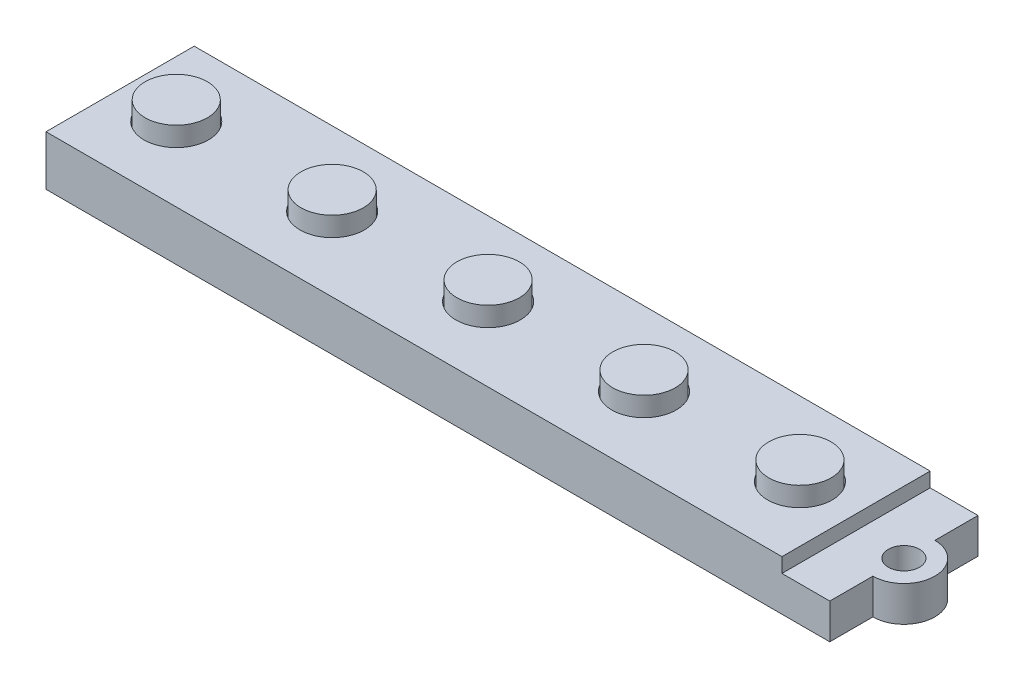
ISO-10303-21;
HEADER;
FILE_DESCRIPTION(('STEP AP214'),'2;1');
FILE_NAME('part.step','',(''),(''),'','','');
FILE_SCHEMA(('AUTOMOTIVE_DESIGN { 1 0 10303 214 1 1 1 1 }'));
ENDSEC;
DATA;
#1=APPLICATION_CONTEXT('core data for automotive mechanical design processes');
#2=APPLICATION_PROTOCOL_DEFINITION('international standard','automotive_design',2000,#1);
#3=PRODUCT_CONTEXT('',#1,'mechanical');
#4=PRODUCT('Part','Part','',(#3));
#5=PRODUCT_RELATED_PRODUCT_CATEGORY('part','',(#4));
#6=PRODUCT_DEFINITION_FORMATION('','',#4);
#7=PRODUCT_DEFINITION_CONTEXT('part definition',#1,'design');
#8=PRODUCT_DEFINITION('design','',#6,#7);
#9=PRODUCT_DEFINITION_SHAPE('','',#8);
#10=(LENGTH_UNIT() NAMED_UNIT(*) SI_UNIT(.MILLI.,.METRE.));
#11=(NAMED_UNIT(*) PLANE_ANGLE_UNIT() SI_UNIT($,.RADIAN.));
#12=(NAMED_UNIT(*) SI_UNIT($,.STERADIAN.) SOLID_ANGLE_UNIT());
#13=UNCERTAINTY_MEASURE_WITH_UNIT(LENGTH_MEASURE(1.E-05),#10,'distance_accuracy_value','');
#14=(GEOMETRIC_REPRESENTATION_CONTEXT(3) GLOBAL_UNCERTAINTY_ASSIGNED_CONTEXT((#13)) GLOBAL_UNIT_ASSIGNED_CONTEXT((#10,
#11,#12)) REPRESENTATION_CONTEXT('',''));
#15=CARTESIAN_POINT('',(0.,0.,0.));
#16=DIRECTION('',(0.,0.,1.));
#17=DIRECTION('',(1.,0.,0.));
#18=AXIS2_PLACEMENT_3D('',#15,#16,#17);
#19=CARTESIAN_POINT('',(0.,0.,0.));
#20=DIRECTION('',(0.,1.,0.));
#21=DIRECTION('',(0.,0.,1.));
#22=AXIS2_PLACEMENT_3D('',#19,#20,#21);
#23=PLANE('',#22);
#24=CARTESIAN_POINT('',(-20.4046666666667,0.,-25.8942737373737));
#25=DIRECTION('',(0.,1.,0.));
#26=DIRECTION('',(0.,0.,1.));
#27=AXIS2_PLACEMENT_3D('',#24,#25,#26);
#28=CIRCLE('',#27,1.905);
#29=CARTESIAN_POINT('',(-20.4046666666667,0.,-23.9892737373737));
#30=VERTEX_POINT('',#29);
#31=EDGE_CURVE('E222',#30,#30,#28,.T.);
#32=ORIENTED_EDGE('',*,*,#31,.T.);
#33=EDGE_LOOP('',(#32));
#34=FACE_BOUND('',#33,.T.);
#35=DIRECTION('',(0.,0.,-1.));
#36=VECTOR('',#35,1.);
#37=CARTESIAN_POINT('',(-112.479666666667,0.,-32.2442737373737));
#38=LINE('',#37,#36);
#39=CARTESIAN_POINT('',(-112.479666666667,0.,-19.5442737373737));
#40=VERTEX_POINT('',#39);
#41=CARTESIAN_POINT('',(-112.479666666667,0.,-32.2442737373737));
#42=VERTEX_POINT('',#41);
#43=EDGE_CURVE('E161',#40,#42,#38,.T.);
#44=ORIENTED_EDGE('',*,*,#43,.F.);
#45=DIRECTION('',(-1.,0.,0.));
#46=VECTOR('',#45,1.);
#47=CARTESIAN_POINT('',(-29.9296666666666,0.,-19.5442737373737));
#48=LINE('',#47,#46);
#49=CARTESIAN_POINT('',(-29.9296666666666,0.,-19.5442737373737));
#50=VERTEX_POINT('',#49);
#51=EDGE_CURVE('E166',#50,#40,#48,.T.);
#52=ORIENTED_EDGE('',*,*,#51,.F.);
#53=DIRECTION('',(0.,0.,1.));
#54=VECTOR('',#53,1.);
#55=CARTESIAN_POINT('',(-29.9296666666666,0.,-32.2442737373737));
#56=LINE('',#55,#54);
#57=CARTESIAN_POINT('',(-29.9296666666666,0.,-32.2442737373737));
#58=VERTEX_POINT('',#57);
#59=EDGE_CURVE('E176',#58,#50,#56,.T.);
#60=ORIENTED_EDGE('',*,*,#59,.F.);
#61=DIRECTION('',(1.,0.,0.));
#62=VECTOR('',#61,1.);
#63=CARTESIAN_POINT('',(-29.9296666666666,0.,-32.2442737373737));
#64=LINE('',#63,#62);
#65=EDGE_CURVE('E59',#42,#58,#64,.T.);
#66=ORIENTED_EDGE('',*,*,#65,.F.);
#67=EDGE_LOOP('',(#44,#52,#60,#66));
#68=FACE_BOUND('',#67,.T.);
#69=DIRECTION('',(-1.,0.,0.));
#70=VECTOR('',#69,1.);
#71=CARTESIAN_POINT('',(-116.162666666667,0.,-34.9493737373737));
#72=LINE('',#71,#70);
#73=CARTESIAN_POINT('',(-20.4046666666667,0.,-34.9493737373737));
#74=VERTEX_POINT('',#73);
#75=CARTESIAN_POINT('',(-116.162666666667,0.,-34.9493737373737));
#76=VERTEX_POINT('',#75);
#77=EDGE_CURVE('E244',#74,#76,#72,.T.);
#78=ORIENTED_EDGE('',*,*,#77,.F.);
#79=DIRECTION('',(0.,0.,1.));
#80=VECTOR('',#79,1.);
#81=CARTESIAN_POINT('',(-20.4046666666667,0.,0.));
#82=LINE('',#81,#80);
#83=CARTESIAN_POINT('',(-20.4046666666667,0.,-29.6800450522713));
#84=VERTEX_POINT('',#83);
#85=EDGE_CURVE('E158',#74,#84,#82,.T.);
#86=ORIENTED_EDGE('',*,*,#85,.T.);
#87=CARTESIAN_POINT('',(-20.4046666666667,0.,-25.8942737373737));
#88=DIRECTION('',(0.,1.,0.));
#89=DIRECTION('',(0.,0.,1.));
#90=AXIS2_PLACEMENT_3D('',#87,#88,#89);
#91=CIRCLE('',#90,3.78577131489756);
#92=CARTESIAN_POINT('',(-20.4046666666667,0.,-22.1085024224762));
#93=VERTEX_POINT('',#92);
#94=EDGE_CURVE('E154',#84,#93,#91,.F.);
#95=ORIENTED_EDGE('',*,*,#94,.T.);
#96=DIRECTION('',(0.,0.,1.));
#97=VECTOR('',#96,1.);
#98=CARTESIAN_POINT('',(-20.4046666666666,0.,0.));
#99=LINE('',#98,#97);
#100=CARTESIAN_POINT('',(-20.4046666666666,0.,-16.8391737373737));
#101=VERTEX_POINT('',#100);
#102=EDGE_CURVE('E132',#93,#101,#99,.T.);
#103=ORIENTED_EDGE('',*,*,#102,.T.);
#104=DIRECTION('',(1.,0.,0.));
#105=VECTOR('',#104,1.);
#106=CARTESIAN_POINT('',(-116.162666666667,0.,-16.8391737373737));
#107=LINE('',#106,#105);
#108=CARTESIAN_POINT('',(-116.162666666667,0.,-16.8391737373737));
#109=VERTEX_POINT('',#108);
#110=EDGE_CURVE('E251',#109,#101,#107,.T.);
#111=ORIENTED_EDGE('',*,*,#110,.F.);
#112=DIRECTION('',(0.,0.,1.));
#113=VECTOR('',#112,1.);
#114=CARTESIAN_POINT('',(-116.162666666667,0.,-34.9493737373737));
#115=LINE('',#114,#113);
#116=EDGE_CURVE('E237',#76,#109,#115,.T.);
#117=ORIENTED_EDGE('',*,*,#116,.F.);
#118=EDGE_LOOP('',(#78,#86,#95,#103,#111,#117));
#119=FACE_BOUND('',#118,.T.);
#120=ADVANCED_FACE('F36',(#34,#68,#119),#23,.F.);
#121=CARTESIAN_POINT('',(0.,4.318,0.));
#122=DIRECTION('',(0.,1.,0.));
#123=DIRECTION('',(0.,0.,1.));
#124=AXIS2_PLACEMENT_3D('',#121,#122,#123);
#125=PLANE('',#124);
#126=CARTESIAN_POINT('',(-20.4046666666667,4.318,-25.8942737373737));
#127=DIRECTION('',(0.,1.,0.));
#128=DIRECTION('',(0.,0.,1.));
#129=AXIS2_PLACEMENT_3D('',#126,#127,#128);
#130=CIRCLE('',#129,1.905);
#131=CARTESIAN_POINT('',(-20.4046666666667,4.318,-23.9892737373737));
#132=VERTEX_POINT('',#131);
#133=EDGE_CURVE('E219',#132,#132,#130,.T.);
#134=ORIENTED_EDGE('',*,*,#133,.F.);
#135=EDGE_LOOP('',(#134));
#136=FACE_BOUND('',#135,.T.);
#137=DIRECTION('',(0.,0.,1.));
#138=VECTOR('',#137,1.);
#139=CARTESIAN_POINT('',(-20.4046666666667,4.318,-34.9493737373737));
#140=LINE('',#139,#138);
#141=CARTESIAN_POINT('',(-20.4046666666667,4.318,-34.9493737373737));
#142=VERTEX_POINT('',#141);
#143=CARTESIAN_POINT('',(-20.4046666666667,4.318,-29.6800450522713));
#144=VERTEX_POINT('',#143);
#145=EDGE_CURVE('E51',#142,#144,#140,.T.);
#146=ORIENTED_EDGE('',*,*,#145,.F.);
#147=DIRECTION('',(-1.,0.,0.));
#148=VECTOR('',#147,1.);
#149=CARTESIAN_POINT('',(-26.2466666666667,4.318,-34.9493737373737));
#150=LINE('',#149,#148);
#151=CARTESIAN_POINT('',(-26.2466666666667,4.318,-34.9493737373737));
#152=VERTEX_POINT('',#151);
#153=EDGE_CURVE('E231',#142,#152,#150,.T.);
#154=ORIENTED_EDGE('',*,*,#153,.T.);
#155=DIRECTION('',(0.,0.,1.));
#156=VECTOR('',#155,1.);
#157=CARTESIAN_POINT('',(-26.2466666666667,4.318,-34.9493737373737));
#158=LINE('',#157,#156);
#159=CARTESIAN_POINT('',(-26.2466666666667,4.318,-16.8391737373737));
#160=VERTEX_POINT('',#159);
#161=EDGE_CURVE('E228',#152,#160,#158,.T.);
#162=ORIENTED_EDGE('',*,*,#161,.T.);
#163=DIRECTION('',(1.,0.,0.));
#164=VECTOR('',#163,1.);
#165=CARTESIAN_POINT('',(-26.2466666666667,4.318,-16.8391737373737));
#166=LINE('',#165,#164);
#167=CARTESIAN_POINT('',(-20.4046666666666,4.318,-16.8391737373737));
#168=VERTEX_POINT('',#167);
#169=EDGE_CURVE('E147',#160,#168,#166,.T.);
#170=ORIENTED_EDGE('',*,*,#169,.T.);
#171=DIRECTION('',(0.,0.,1.));
#172=VECTOR('',#171,1.);
#173=CARTESIAN_POINT('',(-20.4046666666667,4.318,-22.1085024224762));
#174=LINE('',#173,#172);
#175=CARTESIAN_POINT('',(-20.4046666666667,4.318,-22.1085024224762));
#176=VERTEX_POINT('',#175);
#177=EDGE_CURVE('E129',#176,#168,#174,.T.);
#178=ORIENTED_EDGE('',*,*,#177,.F.);
#179=CARTESIAN_POINT('',(-20.4046666666667,4.318,-25.8942737373737));
#180=DIRECTION('',(0.,-1.,0.));
#181=DIRECTION('',(0.,0.,1.));
#182=AXIS2_PLACEMENT_3D('',#179,#180,#181);
#183=CIRCLE('',#182,3.78577131489756);
#184=EDGE_CURVE('E139',#144,#176,#183,.T.);
#185=ORIENTED_EDGE('',*,*,#184,.F.);
#186=EDGE_LOOP('',(#146,#154,#162,#170,#178,#185));
#187=FACE_BOUND('',#186,.T.);
#188=ADVANCED_FACE('F144',(#136,#187),#125,.T.);
#189=CARTESIAN_POINT('',(-116.162666666667,6.096,-34.9493737373737));
#190=DIRECTION('',(1.,0.,0.));
#191=DIRECTION('',(0.,0.,-1.));
#192=AXIS2_PLACEMENT_3D('',#189,#190,#191);
#193=PLANE('',#192);
#194=ORIENTED_EDGE('',*,*,#116,.T.);
#195=DIRECTION('',(0.,-1.,0.));
#196=VECTOR('',#195,1.);
#197=CARTESIAN_POINT('',(-116.162666666667,6.096,-16.8391737373737));
#198=LINE('',#197,#196);
#199=CARTESIAN_POINT('',(-116.162666666667,6.096,-16.8391737373737));
#200=VERTEX_POINT('',#199);
#201=EDGE_CURVE('E11',#200,#109,#198,.T.);
#202=ORIENTED_EDGE('',*,*,#201,.F.);
#203=DIRECTION('',(0.,0.,1.));
#204=VECTOR('',#203,1.);
#205=CARTESIAN_POINT('',(-116.162666666667,6.096,-34.9493737373737));
#206=LINE('',#205,#204);
#207=CARTESIAN_POINT('',(-116.162666666667,6.096,-34.9493737373737));
#208=VERTEX_POINT('',#207);
#209=EDGE_CURVE('E240',#208,#200,#206,.T.);
#210=ORIENTED_EDGE('',*,*,#209,.F.);
#211=DIRECTION('',(0.,-1.,0.));
#212=VECTOR('',#211,1.);
#213=CARTESIAN_POINT('',(-116.162666666667,6.096,-34.9493737373737));
#214=LINE('',#213,#212);
#215=EDGE_CURVE('E44',#208,#76,#214,.T.);
#216=ORIENTED_EDGE('',*,*,#215,.T.);
#217=EDGE_LOOP('',(#194,#202,#210,#216));
#218=FACE_BOUND('',#217,.T.);
#219=ADVANCED_FACE('F38',(#218),#193,.F.);
#220=CARTESIAN_POINT('',(-116.162666666667,6.096,-16.8391737373737));
#221=DIRECTION('',(0.,0.,-1.));
#222=DIRECTION('',(-1.,0.,0.));
#223=AXIS2_PLACEMENT_3D('',#220,#221,#222);
#224=PLANE('',#223);
#225=ORIENTED_EDGE('',*,*,#110,.T.);
#226=DIRECTION('',(0.,1.,0.));
#227=VECTOR('',#226,1.);
#228=CARTESIAN_POINT('',(-20.4046666666666,-1.27,-16.8391737373737));
#229=LINE('',#228,#227);
#230=EDGE_CURVE('E135',#101,#168,#229,.T.);
#231=ORIENTED_EDGE('',*,*,#230,.T.);
#232=ORIENTED_EDGE('',*,*,#169,.F.);
#233=DIRECTION('',(0.,1.,0.));
#234=VECTOR('',#233,1.);
#235=CARTESIAN_POINT('',(-26.2466666666667,4.318,-16.8391737373737));
#236=LINE('',#235,#234);
#237=CARTESIAN_POINT('',(-26.2466666666667,6.096,-16.8391737373737));
#238=VERTEX_POINT('',#237);
#239=EDGE_CURVE('E233',#160,#238,#236,.T.);
#240=ORIENTED_EDGE('',*,*,#239,.T.);
#241=DIRECTION('',(1.,0.,0.));
#242=VECTOR('',#241,1.);
#243=CARTESIAN_POINT('',(-116.162666666667,6.096,-16.8391737373737));
#244=LINE('',#243,#242);
#245=EDGE_CURVE('E243',#200,#238,#244,.T.);
#246=ORIENTED_EDGE('',*,*,#245,.F.);
#247=ORIENTED_EDGE('',*,*,#201,.T.);
#248=EDGE_LOOP('',(#225,#231,#232,#240,#246,#247));
#249=FACE_BOUND('',#248,.T.);
#250=ADVANCED_FACE('F265',(#249),#224,.F.);
#251=CARTESIAN_POINT('',(-116.162666666667,6.096,-34.9493737373737));
#252=DIRECTION('',(0.,0.,1.));
#253=DIRECTION('',(1.,0.,0.));
#254=AXIS2_PLACEMENT_3D('',#251,#252,#253);
#255=PLANE('',#254);
#256=ORIENTED_EDGE('',*,*,#153,.F.);
#257=DIRECTION('',(0.,1.,0.));
#258=VECTOR('',#257,1.);
#259=CARTESIAN_POINT('',(-20.4046666666667,-1.27,-34.9493737373737));
#260=LINE('',#259,#258);
#261=EDGE_CURVE('E152',#74,#142,#260,.T.);
#262=ORIENTED_EDGE('',*,*,#261,.F.);
#263=ORIENTED_EDGE('',*,*,#77,.T.);
#264=ORIENTED_EDGE('',*,*,#215,.F.);
#265=DIRECTION('',(-1.,0.,0.));
#266=VECTOR('',#265,1.);
#267=CARTESIAN_POINT('',(-116.162666666667,6.096,-34.9493737373737));
#268=LINE('',#267,#266);
#269=CARTESIAN_POINT('',(-26.2466666666667,6.096,-34.9493737373737));
#270=VERTEX_POINT('',#269);
#271=EDGE_CURVE('E247',#270,#208,#268,.T.);
#272=ORIENTED_EDGE('',*,*,#271,.F.);
#273=DIRECTION('',(0.,1.,0.));
#274=VECTOR('',#273,1.);
#275=CARTESIAN_POINT('',(-26.2466666666667,4.318,-34.9493737373737));
#276=LINE('',#275,#274);
#277=EDGE_CURVE('E235',#152,#270,#276,.T.);
#278=ORIENTED_EDGE('',*,*,#277,.F.);
#279=EDGE_LOOP('',(#256,#262,#263,#264,#272,#278));
#280=FACE_BOUND('',#279,.T.);
#281=ADVANCED_FACE('F271',(#280),#255,.F.);
#282=CARTESIAN_POINT('',(0.,6.096,0.));
#283=DIRECTION('',(0.,1.,0.));
#284=DIRECTION('',(0.,0.,1.));
#285=AXIS2_PLACEMENT_3D('',#282,#283,#284);
#286=PLANE('',#285);
#287=CARTESIAN_POINT('',(-52.1546666666667,6.096,-25.8942737373736));
#288=DIRECTION('',(0.,1.,0.));
#289=DIRECTION('',(0.,0.,1.));
#290=AXIS2_PLACEMENT_3D('',#287,#288,#289);
#291=CIRCLE('',#290,3.937);
#292=CARTESIAN_POINT('',(-52.1546666666667,6.096,-21.9572737373736));
#293=VERTEX_POINT('',#292);
#294=EDGE_CURVE('E196',#293,#293,#291,.T.);
#295=ORIENTED_EDGE('',*,*,#294,.F.);
#296=EDGE_LOOP('',(#295));
#297=FACE_BOUND('',#296,.T.);
#298=CARTESIAN_POINT('',(-71.2046666666667,6.096,-25.8942737373734));
#299=DIRECTION('',(0.,1.,0.));
#300=DIRECTION('',(0.,0.,1.));
#301=AXIS2_PLACEMENT_3D('',#298,#299,#300);
#302=CIRCLE('',#301,3.937);
#303=CARTESIAN_POINT('',(-71.2046666666667,6.096,-21.9572737373734));
#304=VERTEX_POINT('',#303);
#305=EDGE_CURVE('E202',#304,#304,#302,.T.);
#306=ORIENTED_EDGE('',*,*,#305,.F.);
#307=EDGE_LOOP('',(#306));
#308=FACE_BOUND('',#307,.T.);
#309=CARTESIAN_POINT('',(-90.2546666666667,6.096,-25.8942737373733));
#310=DIRECTION('',(0.,1.,0.));
#311=DIRECTION('',(0.,0.,1.));
#312=AXIS2_PLACEMENT_3D('',#309,#310,#311);
#313=CIRCLE('',#312,3.937);
#314=CARTESIAN_POINT('',(-90.2546666666667,6.096,-21.9572737373733));
#315=VERTEX_POINT('',#314);
#316=EDGE_CURVE('E208',#315,#315,#313,.T.);
#317=ORIENTED_EDGE('',*,*,#316,.F.);
#318=EDGE_LOOP('',(#317));
#319=FACE_BOUND('',#318,.T.);
#320=CARTESIAN_POINT('',(-109.304666666667,6.096,-25.8942737373732));
#321=DIRECTION('',(0.,1.,0.));
#322=DIRECTION('',(0.,0.,1.));
#323=AXIS2_PLACEMENT_3D('',#320,#321,#322);
#324=CIRCLE('',#323,3.937);
#325=CARTESIAN_POINT('',(-109.304666666667,6.096,-21.9572737373732));
#326=VERTEX_POINT('',#325);
#327=EDGE_CURVE('E191',#326,#326,#324,.T.);
#328=ORIENTED_EDGE('',*,*,#327,.F.);
#329=EDGE_LOOP('',(#328));
#330=FACE_BOUND('',#329,.T.);
#331=CARTESIAN_POINT('',(-33.1046666666667,6.096,-25.8942737373737));
#332=DIRECTION('',(0.,1.,0.));
#333=DIRECTION('',(0.,0.,1.));
#334=AXIS2_PLACEMENT_3D('',#331,#332,#333);
#335=CIRCLE('',#334,3.937);
#336=CARTESIAN_POINT('',(-33.1046666666667,6.096,-21.9572737373737));
#337=VERTEX_POINT('',#336);
#338=EDGE_CURVE('E195',#337,#337,#335,.T.);
#339=ORIENTED_EDGE('',*,*,#338,.F.);
#340=EDGE_LOOP('',(#339));
#341=FACE_BOUND('',#340,.T.);
#342=DIRECTION('',(0.,0.,1.));
#343=VECTOR('',#342,1.);
#344=CARTESIAN_POINT('',(-26.2466666666667,6.096,-34.9493737373737));
#345=LINE('',#344,#343);
#346=EDGE_CURVE('E225',#270,#238,#345,.T.);
#347=ORIENTED_EDGE('',*,*,#346,.F.);
#348=ORIENTED_EDGE('',*,*,#271,.T.);
#349=ORIENTED_EDGE('',*,*,#209,.T.);
#350=ORIENTED_EDGE('',*,*,#245,.T.);
#351=EDGE_LOOP('',(#347,#348,#349,#350));
#352=FACE_BOUND('',#351,.T.);
#353=ADVANCED_FACE('F268',(#297,#308,#319,#330,#341,#352),#286,.T.);
#354=CARTESIAN_POINT('',(-26.2466666666667,4.318,-34.9493737373737));
#355=DIRECTION('',(-1.,0.,0.));
#356=DIRECTION('',(0.,0.,1.));
#357=AXIS2_PLACEMENT_3D('',#354,#355,#356);
#358=PLANE('',#357);
#359=ORIENTED_EDGE('',*,*,#346,.T.);
#360=ORIENTED_EDGE('',*,*,#239,.F.);
#361=ORIENTED_EDGE('',*,*,#161,.F.);
#362=ORIENTED_EDGE('',*,*,#277,.T.);
#363=EDGE_LOOP('',(#359,#360,#361,#362));
#364=FACE_BOUND('',#363,.T.);
#365=ADVANCED_FACE('F275',(#364),#358,.F.);
#366=CARTESIAN_POINT('',(-20.4046666666667,0.,-25.8942737373737));
#367=DIRECTION('',(0.,1.,0.));
#368=DIRECTION('',(0.,0.,1.));
#369=AXIS2_PLACEMENT_3D('',#366,#367,#368);
#370=CYLINDRICAL_SURFACE('',#369,1.905);
#371=ORIENTED_EDGE('',*,*,#31,.F.);
#372=EDGE_LOOP('',(#371));
#373=FACE_BOUND('',#372,.T.);
#374=ORIENTED_EDGE('',*,*,#133,.T.);
#375=EDGE_LOOP('',(#374));
#376=FACE_BOUND('',#375,.T.);
#377=ADVANCED_FACE('F339',(#373,#376),#370,.F.);
#378=CARTESIAN_POINT('',(-33.1046666666667,4.826,-25.8942737373737));
#379=DIRECTION('',(0.,1.,0.));
#380=DIRECTION('',(0.,0.,1.));
#381=AXIS2_PLACEMENT_3D('',#378,#379,#380);
#382=CYLINDRICAL_SURFACE('',#381,3.937);
#383=CARTESIAN_POINT('',(-33.1046666666667,4.826,-25.8942737373737));
#384=DIRECTION('',(0.,1.,0.));
#385=DIRECTION('',(0.,0.,1.));
#386=AXIS2_PLACEMENT_3D('',#383,#384,#385);
#387=CIRCLE('',#386,3.937);
#388=CARTESIAN_POINT('',(-33.1046666666667,4.826,-21.9572737373737));
#389=VERTEX_POINT('',#388);
#390=EDGE_CURVE('E216',#389,#389,#387,.T.);
#391=ORIENTED_EDGE('',*,*,#390,.F.);
#392=EDGE_LOOP('',(#391));
#393=FACE_BOUND('',#392,.T.);
#394=ORIENTED_EDGE('',*,*,#338,.T.);
#395=EDGE_LOOP('',(#394));
#396=FACE_BOUND('',#395,.T.);
#397=ADVANCED_FACE('F337',(#393,#396),#382,.F.);
#398=CARTESIAN_POINT('',(-33.1046666666667,4.826,-25.8942737373737));
#399=DIRECTION('',(0.,1.,0.));
#400=DIRECTION('',(0.,0.,1.));
#401=AXIS2_PLACEMENT_3D('',#398,#399,#400);
#402=PLANE('',#401);
#403=CARTESIAN_POINT('',(-33.1046666666667,4.826,-25.8942737373737));
#404=DIRECTION('',(0.,1.,0.));
#405=DIRECTION('',(0.,0.,1.));
#406=AXIS2_PLACEMENT_3D('',#403,#404,#405);
#407=CIRCLE('',#406,3.81);
#408=CARTESIAN_POINT('',(-33.1046666666667,4.826,-22.0842737373737));
#409=VERTEX_POINT('',#408);
#410=EDGE_CURVE('E278',#409,#409,#407,.T.);
#411=ORIENTED_EDGE('',*,*,#410,.F.);
#412=EDGE_LOOP('',(#411));
#413=FACE_BOUND('',#412,.T.);
#414=ORIENTED_EDGE('',*,*,#390,.T.);
#415=EDGE_LOOP('',(#414));
#416=FACE_BOUND('',#415,.T.);
#417=ADVANCED_FACE('F327',(#413,#416),#402,.T.);
#418=CARTESIAN_POINT('',(-109.304666666667,4.826,-25.8942737373732));
#419=DIRECTION('',(0.,1.,0.));
#420=DIRECTION('',(0.,0.,1.));
#421=AXIS2_PLACEMENT_3D('',#418,#419,#420);
#422=CYLINDRICAL_SURFACE('',#421,3.937);
#423=CARTESIAN_POINT('',(-109.304666666667,4.826,-25.8942737373732));
#424=DIRECTION('',(0.,1.,0.));
#425=DIRECTION('',(0.,0.,1.));
#426=AXIS2_PLACEMENT_3D('',#423,#424,#425);
#427=CIRCLE('',#426,3.937);
#428=CARTESIAN_POINT('',(-109.304666666667,4.826,-21.9572737373732));
#429=VERTEX_POINT('',#428);
#430=EDGE_CURVE('E211',#429,#429,#427,.T.);
#431=ORIENTED_EDGE('',*,*,#430,.F.);
#432=EDGE_LOOP('',(#431));
#433=FACE_BOUND('',#432,.T.);
#434=ORIENTED_EDGE('',*,*,#327,.T.);
#435=EDGE_LOOP('',(#434));
#436=FACE_BOUND('',#435,.T.);
#437=ADVANCED_FACE('F321',(#433,#436),#422,.F.);
#438=CARTESIAN_POINT('',(-109.304666666667,4.826,-25.8942737373732));
#439=DIRECTION('',(0.,1.,0.));
#440=DIRECTION('',(0.,0.,1.));
#441=AXIS2_PLACEMENT_3D('',#438,#439,#440);
#442=PLANE('',#441);
#443=CARTESIAN_POINT('',(-109.304666666667,4.826,-25.8942737373732));
#444=DIRECTION('',(0.,1.,0.));
#445=DIRECTION('',(0.,0.,1.));
#446=AXIS2_PLACEMENT_3D('',#443,#444,#445);
#447=CIRCLE('',#446,3.81);
#448=CARTESIAN_POINT('',(-109.304666666667,4.826,-22.0842737373732));
#449=VERTEX_POINT('',#448);
#450=EDGE_CURVE('E302',#449,#449,#447,.T.);
#451=ORIENTED_EDGE('',*,*,#450,.F.);
#452=EDGE_LOOP('',(#451));
#453=FACE_BOUND('',#452,.T.);
#454=ORIENTED_EDGE('',*,*,#430,.T.);
#455=EDGE_LOOP('',(#454));
#456=FACE_BOUND('',#455,.T.);
#457=ADVANCED_FACE('F317',(#453,#456),#442,.T.);
#458=CARTESIAN_POINT('',(-90.2546666666667,4.826,-25.8942737373733));
#459=DIRECTION('',(0.,1.,0.));
#460=DIRECTION('',(0.,0.,1.));
#461=AXIS2_PLACEMENT_3D('',#458,#459,#460);
#462=CYLINDRICAL_SURFACE('',#461,3.937);
#463=CARTESIAN_POINT('',(-90.2546666666667,4.826,-25.8942737373733));
#464=DIRECTION('',(0.,1.,0.));
#465=DIRECTION('',(0.,0.,1.));
#466=AXIS2_PLACEMENT_3D('',#463,#464,#465);
#467=CIRCLE('',#466,3.937);
#468=CARTESIAN_POINT('',(-90.2546666666667,4.826,-21.9572737373733));
#469=VERTEX_POINT('',#468);
#470=EDGE_CURVE('E205',#469,#469,#467,.T.);
#471=ORIENTED_EDGE('',*,*,#470,.F.);
#472=EDGE_LOOP('',(#471));
#473=FACE_BOUND('',#472,.T.);
#474=ORIENTED_EDGE('',*,*,#316,.T.);
#475=EDGE_LOOP('',(#474));
#476=FACE_BOUND('',#475,.T.);
#477=ADVANCED_FACE('F320',(#473,#476),#462,.F.);
#478=CARTESIAN_POINT('',(-90.2546666666667,4.826,-25.8942737373733));
#479=DIRECTION('',(0.,1.,0.));
#480=DIRECTION('',(0.,0.,1.));
#481=AXIS2_PLACEMENT_3D('',#478,#479,#480);
#482=PLANE('',#481);
#483=CARTESIAN_POINT('',(-90.2546666666667,4.826,-25.8942737373733));
#484=DIRECTION('',(0.,1.,0.));
#485=DIRECTION('',(0.,0.,1.));
#486=AXIS2_PLACEMENT_3D('',#483,#484,#485);
#487=CIRCLE('',#486,3.81);
#488=CARTESIAN_POINT('',(-90.2546666666667,4.826,-22.0842737373733));
#489=VERTEX_POINT('',#488);
#490=EDGE_CURVE('E296',#489,#489,#487,.T.);
#491=ORIENTED_EDGE('',*,*,#490,.F.);
#492=EDGE_LOOP('',(#491));
#493=FACE_BOUND('',#492,.T.);
#494=ORIENTED_EDGE('',*,*,#470,.T.);
#495=EDGE_LOOP('',(#494));
#496=FACE_BOUND('',#495,.T.);
#497=ADVANCED_FACE('F465',(#493,#496),#482,.T.);
#498=CARTESIAN_POINT('',(-71.2046666666667,4.826,-25.8942737373734));
#499=DIRECTION('',(0.,1.,0.));
#500=DIRECTION('',(0.,0.,1.));
#501=AXIS2_PLACEMENT_3D('',#498,#499,#500);
#502=CYLINDRICAL_SURFACE('',#501,3.937);
#503=CARTESIAN_POINT('',(-71.2046666666667,4.826,-25.8942737373734));
#504=DIRECTION('',(0.,1.,0.));
#505=DIRECTION('',(0.,0.,1.));
#506=AXIS2_PLACEMENT_3D('',#503,#504,#505);
#507=CIRCLE('',#506,3.937);
#508=CARTESIAN_POINT('',(-71.2046666666667,4.826,-21.9572737373734));
#509=VERTEX_POINT('',#508);
#510=EDGE_CURVE('E199',#509,#509,#507,.T.);
#511=ORIENTED_EDGE('',*,*,#510,.F.);
#512=EDGE_LOOP('',(#511));
#513=FACE_BOUND('',#512,.T.);
#514=ORIENTED_EDGE('',*,*,#305,.T.);
#515=EDGE_LOOP('',(#514));
#516=FACE_BOUND('',#515,.T.);
#517=ADVANCED_FACE('F459',(#513,#516),#502,.F.);
#518=CARTESIAN_POINT('',(-71.2046666666667,4.826,-25.8942737373734));
#519=DIRECTION('',(0.,1.,0.));
#520=DIRECTION('',(0.,0.,1.));
#521=AXIS2_PLACEMENT_3D('',#518,#519,#520);
#522=PLANE('',#521);
#523=CARTESIAN_POINT('',(-71.2046666666667,4.826,-25.8942737373734));
#524=DIRECTION('',(0.,1.,0.));
#525=DIRECTION('',(0.,0.,1.));
#526=AXIS2_PLACEMENT_3D('',#523,#524,#525);
#527=CIRCLE('',#526,3.81000000000001);
#528=CARTESIAN_POINT('',(-71.2046666666667,4.826,-22.0842737373734));
#529=VERTEX_POINT('',#528);
#530=EDGE_CURVE('E290',#529,#529,#527,.T.);
#531=ORIENTED_EDGE('',*,*,#530,.F.);
#532=EDGE_LOOP('',(#531));
#533=FACE_BOUND('',#532,.T.);
#534=ORIENTED_EDGE('',*,*,#510,.T.);
#535=EDGE_LOOP('',(#534));
#536=FACE_BOUND('',#535,.T.);
#537=ADVANCED_FACE('F451',(#533,#536),#522,.T.);
#538=CARTESIAN_POINT('',(-52.1546666666667,4.826,-25.8942737373736));
#539=DIRECTION('',(0.,1.,0.));
#540=DIRECTION('',(0.,0.,1.));
#541=AXIS2_PLACEMENT_3D('',#538,#539,#540);
#542=CYLINDRICAL_SURFACE('',#541,3.937);
#543=CARTESIAN_POINT('',(-52.1546666666667,4.826,-25.8942737373736));
#544=DIRECTION('',(0.,1.,0.));
#545=DIRECTION('',(0.,0.,1.));
#546=AXIS2_PLACEMENT_3D('',#543,#544,#545);
#547=CIRCLE('',#546,3.937);
#548=CARTESIAN_POINT('',(-52.1546666666667,4.826,-21.9572737373736));
#549=VERTEX_POINT('',#548);
#550=EDGE_CURVE('E192',#549,#549,#547,.T.);
#551=ORIENTED_EDGE('',*,*,#550,.F.);
#552=EDGE_LOOP('',(#551));
#553=FACE_BOUND('',#552,.T.);
#554=ORIENTED_EDGE('',*,*,#294,.T.);
#555=EDGE_LOOP('',(#554));
#556=FACE_BOUND('',#555,.T.);
#557=ADVANCED_FACE('F445',(#553,#556),#542,.F.);
#558=CARTESIAN_POINT('',(-52.1546666666667,4.826,-25.8942737373736));
#559=DIRECTION('',(0.,1.,0.));
#560=DIRECTION('',(0.,0.,1.));
#561=AXIS2_PLACEMENT_3D('',#558,#559,#560);
#562=PLANE('',#561);
#563=CARTESIAN_POINT('',(-52.1546666666667,4.826,-25.8942737373736));
#564=DIRECTION('',(0.,1.,0.));
#565=DIRECTION('',(0.,0.,1.));
#566=AXIS2_PLACEMENT_3D('',#563,#564,#565);
#567=CIRCLE('',#566,3.81);
#568=CARTESIAN_POINT('',(-52.1546666666667,4.826,-22.0842737373736));
#569=VERTEX_POINT('',#568);
#570=EDGE_CURVE('E284',#569,#569,#567,.T.);
#571=ORIENTED_EDGE('',*,*,#570,.F.);
#572=EDGE_LOOP('',(#571));
#573=FACE_BOUND('',#572,.T.);
#574=ORIENTED_EDGE('',*,*,#550,.T.);
#575=EDGE_LOOP('',(#574));
#576=FACE_BOUND('',#575,.T.);
#577=ADVANCED_FACE('F437',(#573,#576),#562,.T.);
#578=CARTESIAN_POINT('',(-112.479666666667,-1.27,-32.2442737373737));
#579=DIRECTION('',(1.,0.,0.));
#580=DIRECTION('',(0.,0.,-1.));
#581=AXIS2_PLACEMENT_3D('',#578,#579,#580);
#582=PLANE('',#581);
#583=ORIENTED_EDGE('',*,*,#43,.T.);
#584=DIRECTION('',(0.,1.,0.));
#585=VECTOR('',#584,1.);
#586=CARTESIAN_POINT('',(-112.479666666667,-1.27,-32.2442737373737));
#587=LINE('',#586,#585);
#588=CARTESIAN_POINT('',(-112.479666666667,-1.27,-32.2442737373737));
#589=VERTEX_POINT('',#588);
#590=EDGE_CURVE('E189',#589,#42,#587,.T.);
#591=ORIENTED_EDGE('',*,*,#590,.F.);
#592=DIRECTION('',(0.,0.,-1.));
#593=VECTOR('',#592,1.);
#594=CARTESIAN_POINT('',(-112.479666666667,-1.27,-32.2442737373737));
#595=LINE('',#594,#593);
#596=CARTESIAN_POINT('',(-112.479666666667,-1.27,-19.5442737373737));
#597=VERTEX_POINT('',#596);
#598=EDGE_CURVE('E162',#597,#589,#595,.T.);
#599=ORIENTED_EDGE('',*,*,#598,.F.);
#600=DIRECTION('',(0.,1.,0.));
#601=VECTOR('',#600,1.);
#602=CARTESIAN_POINT('',(-112.479666666667,-1.27,-19.5442737373737));
#603=LINE('',#602,#601);
#604=EDGE_CURVE('E172',#597,#40,#603,.T.);
#605=ORIENTED_EDGE('',*,*,#604,.T.);
#606=EDGE_LOOP('',(#583,#591,#599,#605));
#607=FACE_BOUND('',#606,.T.);
#608=ADVANCED_FACE('F426',(#607),#582,.F.);
#609=CARTESIAN_POINT('',(-29.9296666666666,-1.27,-32.2442737373737));
#610=DIRECTION('',(0.,0.,1.));
#611=DIRECTION('',(1.,0.,0.));
#612=AXIS2_PLACEMENT_3D('',#609,#610,#611);
#613=PLANE('',#612);
#614=ORIENTED_EDGE('',*,*,#65,.T.);
#615=DIRECTION('',(0.,1.,0.));
#616=VECTOR('',#615,1.);
#617=CARTESIAN_POINT('',(-29.9296666666666,-1.27,-32.2442737373737));
#618=LINE('',#617,#616);
#619=CARTESIAN_POINT('',(-29.9296666666666,-1.27,-32.2442737373737));
#620=VERTEX_POINT('',#619);
#621=EDGE_CURVE('E186',#620,#58,#618,.T.);
#622=ORIENTED_EDGE('',*,*,#621,.F.);
#623=DIRECTION('',(1.,0.,0.));
#624=VECTOR('',#623,1.);
#625=CARTESIAN_POINT('',(-29.9296666666666,-1.27,-32.2442737373737));
#626=LINE('',#625,#624);
#627=EDGE_CURVE('E165',#589,#620,#626,.T.);
#628=ORIENTED_EDGE('',*,*,#627,.F.);
#629=ORIENTED_EDGE('',*,*,#590,.T.);
#630=EDGE_LOOP('',(#614,#622,#628,#629));
#631=FACE_BOUND('',#630,.T.);
#632=ADVANCED_FACE('F415',(#631),#613,.F.);
#633=CARTESIAN_POINT('',(-29.9296666666666,-1.27,-32.2442737373737));
#634=DIRECTION('',(-1.,0.,0.));
#635=DIRECTION('',(0.,0.,1.));
#636=AXIS2_PLACEMENT_3D('',#633,#634,#635);
#637=PLANE('',#636);
#638=ORIENTED_EDGE('',*,*,#59,.T.);
#639=DIRECTION('',(0.,1.,0.));
#640=VECTOR('',#639,1.);
#641=CARTESIAN_POINT('',(-29.9296666666666,-1.27,-19.5442737373737));
#642=LINE('',#641,#640);
#643=CARTESIAN_POINT('',(-29.9296666666666,-1.27,-19.5442737373737));
#644=VERTEX_POINT('',#643);
#645=EDGE_CURVE('E183',#644,#50,#642,.T.);
#646=ORIENTED_EDGE('',*,*,#645,.F.);
#647=DIRECTION('',(0.,0.,1.));
#648=VECTOR('',#647,1.);
#649=CARTESIAN_POINT('',(-29.9296666666666,-1.27,-32.2442737373737));
#650=LINE('',#649,#648);
#651=EDGE_CURVE('E168',#620,#644,#650,.T.);
#652=ORIENTED_EDGE('',*,*,#651,.F.);
#653=ORIENTED_EDGE('',*,*,#621,.T.);
#654=EDGE_LOOP('',(#638,#646,#652,#653));
#655=FACE_BOUND('',#654,.T.);
#656=ADVANCED_FACE('F404',(#655),#637,.F.);
#657=CARTESIAN_POINT('',(-29.9296666666666,-1.27,-19.5442737373737));
#658=DIRECTION('',(0.,0.,-1.));
#659=DIRECTION('',(-1.,0.,0.));
#660=AXIS2_PLACEMENT_3D('',#657,#658,#659);
#661=PLANE('',#660);
#662=ORIENTED_EDGE('',*,*,#51,.T.);
#663=ORIENTED_EDGE('',*,*,#604,.F.);
#664=DIRECTION('',(-1.,0.,0.));
#665=VECTOR('',#664,1.);
#666=CARTESIAN_POINT('',(-29.9296666666666,-1.27,-19.5442737373737));
#667=LINE('',#666,#665);
#668=EDGE_CURVE('E170',#644,#597,#667,.T.);
#669=ORIENTED_EDGE('',*,*,#668,.F.);
#670=ORIENTED_EDGE('',*,*,#645,.T.);
#671=EDGE_LOOP('',(#662,#663,#669,#670));
#672=FACE_BOUND('',#671,.T.);
#673=ADVANCED_FACE('F392',(#672),#661,.F.);
#674=CARTESIAN_POINT('',(0.,-1.27,0.));
#675=DIRECTION('',(0.,-1.,0.));
#676=DIRECTION('',(0.,0.,-1.));
#677=AXIS2_PLACEMENT_3D('',#674,#675,#676);
#678=PLANE('',#677);
#679=ORIENTED_EDGE('',*,*,#598,.T.);
#680=ORIENTED_EDGE('',*,*,#627,.T.);
#681=ORIENTED_EDGE('',*,*,#651,.T.);
#682=ORIENTED_EDGE('',*,*,#668,.T.);
#683=EDGE_LOOP('',(#679,#680,#681,#682));
#684=FACE_BOUND('',#683,.T.);
#685=ADVANCED_FACE('F385',(#684),#678,.T.);
#686=CARTESIAN_POINT('',(-20.4046666666667,-1.27,-34.9493737373737));
#687=DIRECTION('',(-1.,0.,0.));
#688=DIRECTION('',(0.,0.,1.));
#689=AXIS2_PLACEMENT_3D('',#686,#687,#688);
#690=PLANE('',#689);
#691=ORIENTED_EDGE('',*,*,#261,.T.);
#692=ORIENTED_EDGE('',*,*,#145,.T.);
#693=DIRECTION('',(0.,1.,0.));
#694=VECTOR('',#693,1.);
#695=CARTESIAN_POINT('',(-20.4046666666667,-1.27,-29.6800450522713));
#696=LINE('',#695,#694);
#697=EDGE_CURVE('E136',#84,#144,#696,.T.);
#698=ORIENTED_EDGE('',*,*,#697,.F.);
#699=ORIENTED_EDGE('',*,*,#85,.F.);
#700=EDGE_LOOP('',(#691,#692,#698,#699));
#701=FACE_BOUND('',#700,.T.);
#702=ADVANCED_FACE('F391',(#701),#690,.F.);
#703=CARTESIAN_POINT('',(-20.4046666666667,-1.27,-22.1085024224762));
#704=DIRECTION('',(-1.,0.,0.));
#705=DIRECTION('',(0.,0.,1.));
#706=AXIS2_PLACEMENT_3D('',#703,#704,#705);
#707=PLANE('',#706);
#708=DIRECTION('',(0.,1.,0.));
#709=VECTOR('',#708,1.);
#710=CARTESIAN_POINT('',(-20.4046666666667,-1.27,-22.1085024224762));
#711=LINE('',#710,#709);
#712=EDGE_CURVE('E125',#93,#176,#711,.T.);
#713=ORIENTED_EDGE('',*,*,#712,.T.);
#714=ORIENTED_EDGE('',*,*,#177,.T.);
#715=ORIENTED_EDGE('',*,*,#230,.F.);
#716=ORIENTED_EDGE('',*,*,#102,.F.);
#717=EDGE_LOOP('',(#713,#714,#715,#716));
#718=FACE_BOUND('',#717,.T.);
#719=ADVANCED_FACE('F127',(#718),#707,.F.);
#720=CARTESIAN_POINT('',(-20.4046666666667,-1.27,-25.8942737373737));
#721=DIRECTION('',(0.,1.,0.));
#722=DIRECTION('',(0.,0.,1.));
#723=AXIS2_PLACEMENT_3D('',#720,#721,#722);
#724=CYLINDRICAL_SURFACE('',#723,3.78577131489756);
#725=ORIENTED_EDGE('',*,*,#697,.T.);
#726=ORIENTED_EDGE('',*,*,#184,.T.);
#727=ORIENTED_EDGE('',*,*,#712,.F.);
#728=ORIENTED_EDGE('',*,*,#94,.F.);
#729=EDGE_LOOP('',(#725,#726,#727,#728));
#730=FACE_BOUND('',#729,.T.);
#731=ADVANCED_FACE('F140',(#730),#724,.T.);
#732=CARTESIAN_POINT('',(-33.1046666666667,8.382,-25.8942737373737));
#733=DIRECTION('',(0.,-1.,0.));
#734=DIRECTION('',(0.,0.,-1.));
#735=AXIS2_PLACEMENT_3D('',#732,#733,#734);
#736=CYLINDRICAL_SURFACE('',#735,3.81);
#737=CARTESIAN_POINT('',(-33.1046666666667,8.382,-25.8942737373737));
#738=DIRECTION('',(0.,1.,0.));
#739=DIRECTION('',(0.,0.,1.));
#740=AXIS2_PLACEMENT_3D('',#737,#738,#739);
#741=CIRCLE('',#740,3.81);
#742=CARTESIAN_POINT('',(-33.1046666666667,8.382,-22.0842737373737));
#743=VERTEX_POINT('',#742);
#744=EDGE_CURVE('E276',#743,#743,#741,.T.);
#745=ORIENTED_EDGE('',*,*,#744,.F.);
#746=EDGE_LOOP('',(#745));
#747=FACE_BOUND('',#746,.T.);
#748=ORIENTED_EDGE('',*,*,#410,.T.);
#749=EDGE_LOOP('',(#748));
#750=FACE_BOUND('',#749,.T.);
#751=ADVANCED_FACE('F558',(#747,#750),#736,.T.);
#752=CARTESIAN_POINT('',(-33.1046666666667,8.382,-25.8942737373737));
#753=DIRECTION('',(0.,1.,0.));
#754=DIRECTION('',(0.,0.,1.));
#755=AXIS2_PLACEMENT_3D('',#752,#753,#754);
#756=PLANE('',#755);
#757=ORIENTED_EDGE('',*,*,#744,.T.);
#758=EDGE_LOOP('',(#757));
#759=FACE_BOUND('',#758,.T.);
#760=ADVANCED_FACE('F602',(#759),#756,.T.);
#761=CARTESIAN_POINT('',(-52.1546666666667,8.382,-25.8942737373736));
#762=DIRECTION('',(0.,-1.,0.));
#763=DIRECTION('',(0.,0.,-1.));
#764=AXIS2_PLACEMENT_3D('',#761,#762,#763);
#765=CYLINDRICAL_SURFACE('',#764,3.81);
#766=CARTESIAN_POINT('',(-52.1546666666667,8.382,-25.8942737373736));
#767=DIRECTION('',(0.,1.,0.));
#768=DIRECTION('',(0.,0.,1.));
#769=AXIS2_PLACEMENT_3D('',#766,#767,#768);
#770=CIRCLE('',#769,3.81);
#771=CARTESIAN_POINT('',(-52.1546666666667,8.382,-22.0842737373736));
#772=VERTEX_POINT('',#771);
#773=EDGE_CURVE('E282',#772,#772,#770,.T.);
#774=ORIENTED_EDGE('',*,*,#773,.F.);
#775=EDGE_LOOP('',(#774));
#776=FACE_BOUND('',#775,.T.);
#777=ORIENTED_EDGE('',*,*,#570,.T.);
#778=EDGE_LOOP('',(#777));
#779=FACE_BOUND('',#778,.T.);
#780=ADVANCED_FACE('F613',(#776,#779),#765,.T.);
#781=CARTESIAN_POINT('',(-52.1546666666667,8.382,-25.8942737373736));
#782=DIRECTION('',(0.,1.,0.));
#783=DIRECTION('',(0.,0.,1.));
#784=AXIS2_PLACEMENT_3D('',#781,#782,#783);
#785=PLANE('',#784);
#786=ORIENTED_EDGE('',*,*,#773,.T.);
#787=EDGE_LOOP('',(#786));
#788=FACE_BOUND('',#787,.T.);
#789=ADVANCED_FACE('F624',(#788),#785,.T.);
#790=CARTESIAN_POINT('',(-71.2046666666667,8.382,-25.8942737373734));
#791=DIRECTION('',(0.,-1.,0.));
#792=DIRECTION('',(0.,0.,-1.));
#793=AXIS2_PLACEMENT_3D('',#790,#791,#792);
#794=CYLINDRICAL_SURFACE('',#793,3.81000000000001);
#795=CARTESIAN_POINT('',(-71.2046666666667,8.382,-25.8942737373734));
#796=DIRECTION('',(0.,1.,0.));
#797=DIRECTION('',(0.,0.,1.));
#798=AXIS2_PLACEMENT_3D('',#795,#796,#797);
#799=CIRCLE('',#798,3.81000000000001);
#800=CARTESIAN_POINT('',(-71.2046666666667,8.382,-22.0842737373734));
#801=VERTEX_POINT('',#800);
#802=EDGE_CURVE('E287',#801,#801,#799,.T.);
#803=ORIENTED_EDGE('',*,*,#802,.F.);
#804=EDGE_LOOP('',(#803));
#805=FACE_BOUND('',#804,.T.);
#806=ORIENTED_EDGE('',*,*,#530,.T.);
#807=EDGE_LOOP('',(#806));
#808=FACE_BOUND('',#807,.T.);
#809=ADVANCED_FACE('F635',(#805,#808),#794,.T.);
#810=CARTESIAN_POINT('',(-71.2046666666667,8.382,-25.8942737373734));
#811=DIRECTION('',(0.,1.,0.));
#812=DIRECTION('',(0.,0.,1.));
#813=AXIS2_PLACEMENT_3D('',#810,#811,#812);
#814=PLANE('',#813);
#815=ORIENTED_EDGE('',*,*,#802,.T.);
#816=EDGE_LOOP('',(#815));
#817=FACE_BOUND('',#816,.T.);
#818=ADVANCED_FACE('F646',(#817),#814,.T.);
#819=CARTESIAN_POINT('',(-90.2546666666667,8.382,-25.8942737373733));
#820=DIRECTION('',(0.,-1.,0.));
#821=DIRECTION('',(0.,0.,-1.));
#822=AXIS2_PLACEMENT_3D('',#819,#820,#821);
#823=CYLINDRICAL_SURFACE('',#822,3.81);
#824=CARTESIAN_POINT('',(-90.2546666666667,8.382,-25.8942737373733));
#825=DIRECTION('',(0.,1.,0.));
#826=DIRECTION('',(0.,0.,1.));
#827=AXIS2_PLACEMENT_3D('',#824,#825,#826);
#828=CIRCLE('',#827,3.81);
#829=CARTESIAN_POINT('',(-90.2546666666667,8.382,-22.0842737373733));
#830=VERTEX_POINT('',#829);
#831=EDGE_CURVE('E293',#830,#830,#828,.T.);
#832=ORIENTED_EDGE('',*,*,#831,.F.);
#833=EDGE_LOOP('',(#832));
#834=FACE_BOUND('',#833,.T.);
#835=ORIENTED_EDGE('',*,*,#490,.T.);
#836=EDGE_LOOP('',(#835));
#837=FACE_BOUND('',#836,.T.);
#838=ADVANCED_FACE('F657',(#834,#837),#823,.T.);
#839=CARTESIAN_POINT('',(-90.2546666666667,8.382,-25.8942737373733));
#840=DIRECTION('',(0.,1.,0.));
#841=DIRECTION('',(0.,0.,1.));
#842=AXIS2_PLACEMENT_3D('',#839,#840,#841);
#843=PLANE('',#842);
#844=ORIENTED_EDGE('',*,*,#831,.T.);
#845=EDGE_LOOP('',(#844));
#846=FACE_BOUND('',#845,.T.);
#847=ADVANCED_FACE('F313',(#846),#843,.T.);
#848=CARTESIAN_POINT('',(-109.304666666667,8.382,-25.8942737373732));
#849=DIRECTION('',(0.,-1.,0.));
#850=DIRECTION('',(0.,0.,-1.));
#851=AXIS2_PLACEMENT_3D('',#848,#849,#850);
#852=CYLINDRICAL_SURFACE('',#851,3.81);
#853=CARTESIAN_POINT('',(-109.304666666667,8.382,-25.8942737373732));
#854=DIRECTION('',(0.,1.,0.));
#855=DIRECTION('',(0.,0.,1.));
#856=AXIS2_PLACEMENT_3D('',#853,#854,#855);
#857=CIRCLE('',#856,3.81);
#858=CARTESIAN_POINT('',(-109.304666666667,8.382,-22.0842737373732));
#859=VERTEX_POINT('',#858);
#860=EDGE_CURVE('E299',#859,#859,#857,.T.);
#861=ORIENTED_EDGE('',*,*,#860,.F.);
#862=EDGE_LOOP('',(#861));
#863=FACE_BOUND('',#862,.T.);
#864=ORIENTED_EDGE('',*,*,#450,.T.);
#865=EDGE_LOOP('',(#864));
#866=FACE_BOUND('',#865,.T.);
#867=ADVANCED_FACE('F310',(#863,#866),#852,.T.);
#868=CARTESIAN_POINT('',(-109.304666666667,8.382,-25.8942737373732));
#869=DIRECTION('',(0.,1.,0.));
#870=DIRECTION('',(0.,0.,1.));
#871=AXIS2_PLACEMENT_3D('',#868,#869,#870);
#872=PLANE('',#871);
#873=ORIENTED_EDGE('',*,*,#860,.T.);
#874=EDGE_LOOP('',(#873));
#875=FACE_BOUND('',#874,.T.);
#876=ADVANCED_FACE('F308',(#875),#872,.T.);
#877=CLOSED_SHELL('',(#120,#188,#219,#250,#281,#353,#365,#377,#397,#417,#437,#457,#477,#497,
#517,#537,#557,#577,#608,#632,#656,#673,#685,#702,#719,#731,#751,#760,#780,#789,#809,#818,#838,
#847,#867,#876));
#878=MANIFOLD_SOLID_BREP('B2',#877);
#879=ADVANCED_BREP_SHAPE_REPRESENTATION('',(#18,#878),#14);
#880=SHAPE_DEFINITION_REPRESENTATION(#9,#879);
ENDSEC;
END-ISO-10303-21;
